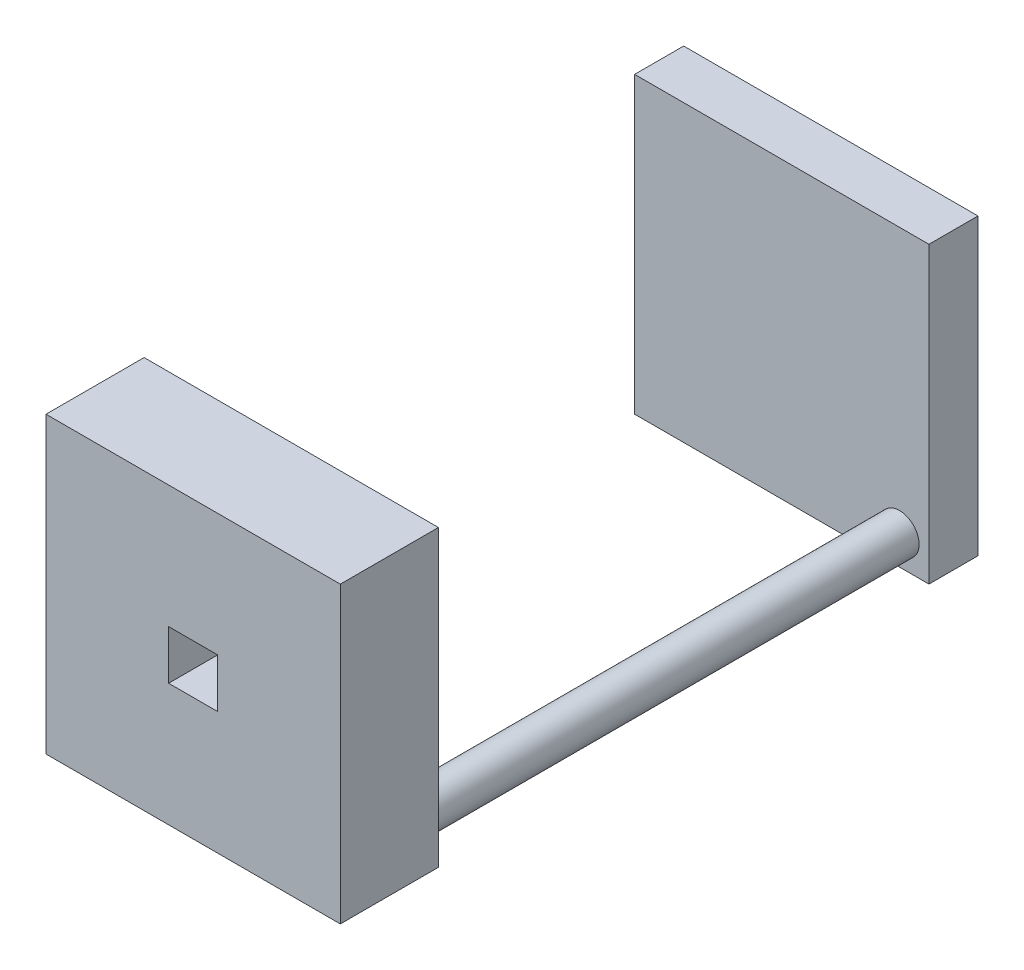
ISO-10303-21;
HEADER;
FILE_DESCRIPTION(('STEP AP214'),'2;1');
FILE_NAME('part.step','',(''),(''),'','','');
FILE_SCHEMA(('AUTOMOTIVE_DESIGN { 1 0 10303 214 1 1 1 1 }'));
ENDSEC;
DATA;
#1=APPLICATION_CONTEXT('core data for automotive mechanical design processes');
#2=APPLICATION_PROTOCOL_DEFINITION('international standard','automotive_design',2000,#1);
#3=PRODUCT_CONTEXT('',#1,'mechanical');
#4=PRODUCT('Part','Part','',(#3));
#5=PRODUCT_RELATED_PRODUCT_CATEGORY('part','',(#4));
#6=PRODUCT_DEFINITION_FORMATION('','',#4);
#7=PRODUCT_DEFINITION_CONTEXT('part definition',#1,'design');
#8=PRODUCT_DEFINITION('design','',#6,#7);
#9=PRODUCT_DEFINITION_SHAPE('','',#8);
#10=(LENGTH_UNIT() NAMED_UNIT(*) SI_UNIT(.MILLI.,.METRE.));
#11=(NAMED_UNIT(*) PLANE_ANGLE_UNIT() SI_UNIT($,.RADIAN.));
#12=(NAMED_UNIT(*) SI_UNIT($,.STERADIAN.) SOLID_ANGLE_UNIT());
#13=UNCERTAINTY_MEASURE_WITH_UNIT(LENGTH_MEASURE(1.E-05),#10,'distance_accuracy_value','');
#14=(GEOMETRIC_REPRESENTATION_CONTEXT(3) GLOBAL_UNCERTAINTY_ASSIGNED_CONTEXT((#13)) GLOBAL_UNIT_ASSIGNED_CONTEXT((#10,
#11,#12)) REPRESENTATION_CONTEXT('',''));
#15=CARTESIAN_POINT('',(0.,0.,0.));
#16=DIRECTION('',(0.,0.,1.));
#17=DIRECTION('',(1.,0.,0.));
#18=AXIS2_PLACEMENT_3D('',#15,#16,#17);
#19=CARTESIAN_POINT('',(0.,30.,0.));
#20=DIRECTION('',(0.,0.,-1.));
#21=DIRECTION('',(-1.,0.,0.));
#22=AXIS2_PLACEMENT_3D('',#19,#20,#21);
#23=PLANE('',#22);
#24=CARTESIAN_POINT('',(27.,3.,0.));
#25=DIRECTION('',(0.,0.,-1.));
#26=DIRECTION('',(-1.,0.,0.));
#27=AXIS2_PLACEMENT_3D('',#24,#25,#26);
#28=CIRCLE('',#27,2.);
#29=CARTESIAN_POINT('',(25.,3.,0.));
#30=VERTEX_POINT('',#29);
#31=EDGE_CURVE('E171',#30,#30,#28,.T.);
#32=ORIENTED_EDGE('',*,*,#31,.F.);
#33=EDGE_LOOP('',(#32));
#34=FACE_BOUND('',#33,.T.);
#35=DIRECTION('',(0.,-1.,0.));
#36=VECTOR('',#35,1.);
#37=CARTESIAN_POINT('',(0.,0.,0.));
#38=LINE('',#37,#36);
#39=CARTESIAN_POINT('',(0.,30.,0.));
#40=VERTEX_POINT('',#39);
#41=CARTESIAN_POINT('',(0.,0.,0.));
#42=VERTEX_POINT('',#41);
#43=EDGE_CURVE('E160',#40,#42,#38,.T.);
#44=ORIENTED_EDGE('',*,*,#43,.F.);
#45=DIRECTION('',(-1.,0.,0.));
#46=VECTOR('',#45,1.);
#47=CARTESIAN_POINT('',(0.,30.,0.));
#48=LINE('',#47,#46);
#49=CARTESIAN_POINT('',(30.,30.,0.));
#50=VERTEX_POINT('',#49);
#51=EDGE_CURVE('E153',#50,#40,#48,.T.);
#52=ORIENTED_EDGE('',*,*,#51,.F.);
#53=DIRECTION('',(0.,1.,0.));
#54=VECTOR('',#53,1.);
#55=CARTESIAN_POINT('',(30.,0.,0.));
#56=LINE('',#55,#54);
#57=CARTESIAN_POINT('',(30.,0.,0.));
#58=VERTEX_POINT('',#57);
#59=EDGE_CURVE('E156',#58,#50,#56,.T.);
#60=ORIENTED_EDGE('',*,*,#59,.F.);
#61=DIRECTION('',(1.,0.,0.));
#62=VECTOR('',#61,1.);
#63=CARTESIAN_POINT('',(0.,0.,0.));
#64=LINE('',#63,#62);
#65=EDGE_CURVE('E158',#42,#58,#64,.T.);
#66=ORIENTED_EDGE('',*,*,#65,.F.);
#67=EDGE_LOOP('',(#44,#52,#60,#66));
#68=FACE_BOUND('',#67,.T.);
#69=DIRECTION('',(-1.,0.,0.));
#70=VECTOR('',#69,1.);
#71=CARTESIAN_POINT('',(0.,17.5,0.));
#72=LINE('',#71,#70);
#73=CARTESIAN_POINT('',(17.5,17.5,0.));
#74=VERTEX_POINT('',#73);
#75=CARTESIAN_POINT('',(12.5,17.5,0.));
#76=VERTEX_POINT('',#75);
#77=EDGE_CURVE('E213',#74,#76,#72,.T.);
#78=ORIENTED_EDGE('',*,*,#77,.T.);
#79=DIRECTION('',(0.,-1.,0.));
#80=VECTOR('',#79,1.);
#81=CARTESIAN_POINT('',(12.5,30.,0.));
#82=LINE('',#81,#80);
#83=CARTESIAN_POINT('',(12.5,12.5,0.));
#84=VERTEX_POINT('',#83);
#85=EDGE_CURVE('E131',#76,#84,#82,.T.);
#86=ORIENTED_EDGE('',*,*,#85,.T.);
#87=DIRECTION('',(1.,0.,0.));
#88=VECTOR('',#87,1.);
#89=CARTESIAN_POINT('',(0.,12.5,0.));
#90=LINE('',#89,#88);
#91=CARTESIAN_POINT('',(17.5,12.5,0.));
#92=VERTEX_POINT('',#91);
#93=EDGE_CURVE('E207',#84,#92,#90,.T.);
#94=ORIENTED_EDGE('',*,*,#93,.T.);
#95=DIRECTION('',(0.,1.,0.));
#96=VECTOR('',#95,1.);
#97=CARTESIAN_POINT('',(17.5,30.,0.));
#98=LINE('',#97,#96);
#99=EDGE_CURVE('E210',#92,#74,#98,.T.);
#100=ORIENTED_EDGE('',*,*,#99,.T.);
#101=EDGE_LOOP('',(#78,#86,#94,#100));
#102=FACE_BOUND('',#101,.T.);
#103=ADVANCED_FACE('F33',(#34,#68,#102),#23,.T.);
#104=CARTESIAN_POINT('',(0.,30.,10.));
#105=DIRECTION('',(0.,0.,-1.));
#106=DIRECTION('',(-1.,0.,0.));
#107=AXIS2_PLACEMENT_3D('',#104,#105,#106);
#108=PLANE('',#107);
#109=DIRECTION('',(0.,-1.,0.));
#110=VECTOR('',#109,1.);
#111=CARTESIAN_POINT('',(0.,0.,10.));
#112=LINE('',#111,#110);
#113=CARTESIAN_POINT('',(0.,30.,10.));
#114=VERTEX_POINT('',#113);
#115=CARTESIAN_POINT('',(0.,0.,10.));
#116=VERTEX_POINT('',#115);
#117=EDGE_CURVE('E155',#114,#116,#112,.T.);
#118=ORIENTED_EDGE('',*,*,#117,.T.);
#119=DIRECTION('',(1.,0.,0.));
#120=VECTOR('',#119,1.);
#121=CARTESIAN_POINT('',(0.,0.,10.));
#122=LINE('',#121,#120);
#123=CARTESIAN_POINT('',(30.,0.,10.));
#124=VERTEX_POINT('',#123);
#125=EDGE_CURVE('E167',#116,#124,#122,.T.);
#126=ORIENTED_EDGE('',*,*,#125,.T.);
#127=DIRECTION('',(0.,1.,0.));
#128=VECTOR('',#127,1.);
#129=CARTESIAN_POINT('',(30.,0.,10.));
#130=LINE('',#129,#128);
#131=CARTESIAN_POINT('',(30.,30.,10.));
#132=VERTEX_POINT('',#131);
#133=EDGE_CURVE('E165',#124,#132,#130,.T.);
#134=ORIENTED_EDGE('',*,*,#133,.T.);
#135=DIRECTION('',(-1.,0.,0.));
#136=VECTOR('',#135,1.);
#137=CARTESIAN_POINT('',(0.,30.,10.));
#138=LINE('',#137,#136);
#139=EDGE_CURVE('E152',#132,#114,#138,.T.);
#140=ORIENTED_EDGE('',*,*,#139,.T.);
#141=EDGE_LOOP('',(#118,#126,#134,#140));
#142=FACE_BOUND('',#141,.T.);
#143=DIRECTION('',(0.,-1.,0.));
#144=VECTOR('',#143,1.);
#145=CARTESIAN_POINT('',(12.5,30.,10.));
#146=LINE('',#145,#144);
#147=CARTESIAN_POINT('',(12.5,17.5,10.));
#148=VERTEX_POINT('',#147);
#149=CARTESIAN_POINT('',(12.5,12.5,10.));
#150=VERTEX_POINT('',#149);
#151=EDGE_CURVE('E11',#148,#150,#146,.T.);
#152=ORIENTED_EDGE('',*,*,#151,.F.);
#153=DIRECTION('',(-1.,0.,0.));
#154=VECTOR('',#153,1.);
#155=CARTESIAN_POINT('',(0.,17.5,10.));
#156=LINE('',#155,#154);
#157=CARTESIAN_POINT('',(17.5,17.5,10.));
#158=VERTEX_POINT('',#157);
#159=EDGE_CURVE('E118',#158,#148,#156,.T.);
#160=ORIENTED_EDGE('',*,*,#159,.F.);
#161=DIRECTION('',(0.,1.,0.));
#162=VECTOR('',#161,1.);
#163=CARTESIAN_POINT('',(17.5,30.,10.));
#164=LINE('',#163,#162);
#165=CARTESIAN_POINT('',(17.5,12.5,10.));
#166=VERTEX_POINT('',#165);
#167=EDGE_CURVE('E123',#166,#158,#164,.T.);
#168=ORIENTED_EDGE('',*,*,#167,.F.);
#169=DIRECTION('',(1.,0.,0.));
#170=VECTOR('',#169,1.);
#171=CARTESIAN_POINT('',(0.,12.5,10.));
#172=LINE('',#171,#170);
#173=EDGE_CURVE('E41',#150,#166,#172,.T.);
#174=ORIENTED_EDGE('',*,*,#173,.F.);
#175=EDGE_LOOP('',(#152,#160,#168,#174));
#176=FACE_BOUND('',#175,.T.);
#177=ADVANCED_FACE('F135',(#142,#176),#108,.F.);
#178=CARTESIAN_POINT('',(0.,0.,10.));
#179=DIRECTION('',(1.,0.,0.));
#180=DIRECTION('',(0.,1.,0.));
#181=AXIS2_PLACEMENT_3D('',#178,#179,#180);
#182=PLANE('',#181);
#183=ORIENTED_EDGE('',*,*,#43,.T.);
#184=DIRECTION('',(0.,0.,-1.));
#185=VECTOR('',#184,1.);
#186=CARTESIAN_POINT('',(0.,0.,10.));
#187=LINE('',#186,#185);
#188=EDGE_CURVE('E124',#116,#42,#187,.T.);
#189=ORIENTED_EDGE('',*,*,#188,.F.);
#190=ORIENTED_EDGE('',*,*,#117,.F.);
#191=DIRECTION('',(0.,0.,-1.));
#192=VECTOR('',#191,1.);
#193=CARTESIAN_POINT('',(0.,30.,10.));
#194=LINE('',#193,#192);
#195=EDGE_CURVE('E149',#114,#40,#194,.T.);
#196=ORIENTED_EDGE('',*,*,#195,.T.);
#197=EDGE_LOOP('',(#183,#189,#190,#196));
#198=FACE_BOUND('',#197,.T.);
#199=ADVANCED_FACE('F35',(#198),#182,.F.);
#200=CARTESIAN_POINT('',(0.,0.,10.));
#201=DIRECTION('',(0.,1.,0.));
#202=DIRECTION('',(0.,0.,1.));
#203=AXIS2_PLACEMENT_3D('',#200,#201,#202);
#204=PLANE('',#203);
#205=ORIENTED_EDGE('',*,*,#65,.T.);
#206=DIRECTION('',(0.,0.,-1.));
#207=VECTOR('',#206,1.);
#208=CARTESIAN_POINT('',(30.,0.,10.));
#209=LINE('',#208,#207);
#210=EDGE_CURVE('E143',#124,#58,#209,.T.);
#211=ORIENTED_EDGE('',*,*,#210,.F.);
#212=ORIENTED_EDGE('',*,*,#125,.F.);
#213=ORIENTED_EDGE('',*,*,#188,.T.);
#214=EDGE_LOOP('',(#205,#211,#212,#213));
#215=FACE_BOUND('',#214,.T.);
#216=ADVANCED_FACE('F252',(#215),#204,.F.);
#217=CARTESIAN_POINT('',(30.,0.,10.));
#218=DIRECTION('',(-1.,0.,0.));
#219=DIRECTION('',(0.,-1.,0.));
#220=AXIS2_PLACEMENT_3D('',#217,#218,#219);
#221=PLANE('',#220);
#222=ORIENTED_EDGE('',*,*,#59,.T.);
#223=DIRECTION('',(0.,0.,-1.));
#224=VECTOR('',#223,1.);
#225=CARTESIAN_POINT('',(30.,30.,10.));
#226=LINE('',#225,#224);
#227=EDGE_CURVE('E146',#132,#50,#226,.T.);
#228=ORIENTED_EDGE('',*,*,#227,.F.);
#229=ORIENTED_EDGE('',*,*,#133,.F.);
#230=ORIENTED_EDGE('',*,*,#210,.T.);
#231=EDGE_LOOP('',(#222,#228,#229,#230));
#232=FACE_BOUND('',#231,.T.);
#233=ADVANCED_FACE('F249',(#232),#221,.F.);
#234=CARTESIAN_POINT('',(0.,30.,10.));
#235=DIRECTION('',(0.,-1.,0.));
#236=DIRECTION('',(0.,0.,-1.));
#237=AXIS2_PLACEMENT_3D('',#234,#235,#236);
#238=PLANE('',#237);
#239=ORIENTED_EDGE('',*,*,#51,.T.);
#240=ORIENTED_EDGE('',*,*,#195,.F.);
#241=ORIENTED_EDGE('',*,*,#139,.F.);
#242=ORIENTED_EDGE('',*,*,#227,.T.);
#243=EDGE_LOOP('',(#239,#240,#241,#242));
#244=FACE_BOUND('',#243,.T.);
#245=ADVANCED_FACE('F245',(#244),#238,.F.);
#246=CARTESIAN_POINT('',(27.,3.,-50.));
#247=DIRECTION('',(0.,0.,1.));
#248=DIRECTION('',(1.,0.,0.));
#249=AXIS2_PLACEMENT_3D('',#246,#247,#248);
#250=CYLINDRICAL_SURFACE('',#249,2.);
#251=CARTESIAN_POINT('',(27.,3.,-50.));
#252=DIRECTION('',(0.,0.,-1.));
#253=DIRECTION('',(-1.,0.,0.));
#254=AXIS2_PLACEMENT_3D('',#251,#252,#253);
#255=CIRCLE('',#254,2.);
#256=CARTESIAN_POINT('',(25.,3.,-50.));
#257=VERTEX_POINT('',#256);
#258=EDGE_CURVE('E163',#257,#257,#255,.T.);
#259=ORIENTED_EDGE('',*,*,#258,.F.);
#260=EDGE_LOOP('',(#259));
#261=FACE_BOUND('',#260,.T.);
#262=ORIENTED_EDGE('',*,*,#31,.T.);
#263=EDGE_LOOP('',(#262));
#264=FACE_BOUND('',#263,.T.);
#265=ADVANCED_FACE('F248',(#261,#264),#250,.T.);
#266=CARTESIAN_POINT('',(30.,30.,-50.));
#267=DIRECTION('',(0.,0.,1.));
#268=DIRECTION('',(1.,0.,0.));
#269=AXIS2_PLACEMENT_3D('',#266,#267,#268);
#270=PLANE('',#269);
#271=DIRECTION('',(0.,-1.,0.));
#272=VECTOR('',#271,1.);
#273=CARTESIAN_POINT('',(30.,0.,-50.));
#274=LINE('',#273,#272);
#275=CARTESIAN_POINT('',(30.,30.,-50.));
#276=VERTEX_POINT('',#275);
#277=CARTESIAN_POINT('',(30.,0.,-50.));
#278=VERTEX_POINT('',#277);
#279=EDGE_CURVE('E196',#276,#278,#274,.T.);
#280=ORIENTED_EDGE('',*,*,#279,.F.);
#281=DIRECTION('',(1.,0.,0.));
#282=VECTOR('',#281,1.);
#283=CARTESIAN_POINT('',(30.,30.,-50.));
#284=LINE('',#283,#282);
#285=CARTESIAN_POINT('',(0.,30.,-50.));
#286=VERTEX_POINT('',#285);
#287=EDGE_CURVE('E189',#286,#276,#284,.T.);
#288=ORIENTED_EDGE('',*,*,#287,.F.);
#289=DIRECTION('',(0.,1.,0.));
#290=VECTOR('',#289,1.);
#291=CARTESIAN_POINT('',(0.,0.,-50.));
#292=LINE('',#291,#290);
#293=CARTESIAN_POINT('',(0.,0.,-50.));
#294=VERTEX_POINT('',#293);
#295=EDGE_CURVE('E192',#294,#286,#292,.T.);
#296=ORIENTED_EDGE('',*,*,#295,.F.);
#297=DIRECTION('',(-1.,0.,0.));
#298=VECTOR('',#297,1.);
#299=CARTESIAN_POINT('',(30.,0.,-50.));
#300=LINE('',#299,#298);
#301=EDGE_CURVE('E194',#278,#294,#300,.T.);
#302=ORIENTED_EDGE('',*,*,#301,.F.);
#303=EDGE_LOOP('',(#280,#288,#296,#302));
#304=FACE_BOUND('',#303,.T.);
#305=ORIENTED_EDGE('',*,*,#258,.T.);
#306=EDGE_LOOP('',(#305));
#307=FACE_BOUND('',#306,.T.);
#308=ADVANCED_FACE('F297',(#304,#307),#270,.T.);
#309=CARTESIAN_POINT('',(30.,0.,-55.));
#310=DIRECTION('',(-1.,0.,0.));
#311=DIRECTION('',(0.,0.,1.));
#312=AXIS2_PLACEMENT_3D('',#309,#310,#311);
#313=PLANE('',#312);
#314=ORIENTED_EDGE('',*,*,#279,.T.);
#315=DIRECTION('',(0.,0.,1.));
#316=VECTOR('',#315,1.);
#317=CARTESIAN_POINT('',(30.,0.,-55.));
#318=LINE('',#317,#316);
#319=CARTESIAN_POINT('',(30.,0.,-55.));
#320=VERTEX_POINT('',#319);
#321=EDGE_CURVE('E174',#320,#278,#318,.T.);
#322=ORIENTED_EDGE('',*,*,#321,.F.);
#323=DIRECTION('',(0.,-1.,0.));
#324=VECTOR('',#323,1.);
#325=CARTESIAN_POINT('',(30.,0.,-55.));
#326=LINE('',#325,#324);
#327=CARTESIAN_POINT('',(30.,30.,-55.));
#328=VERTEX_POINT('',#327);
#329=EDGE_CURVE('E191',#328,#320,#326,.T.);
#330=ORIENTED_EDGE('',*,*,#329,.F.);
#331=DIRECTION('',(0.,0.,1.));
#332=VECTOR('',#331,1.);
#333=CARTESIAN_POINT('',(30.,30.,-55.));
#334=LINE('',#333,#332);
#335=EDGE_CURVE('E185',#328,#276,#334,.T.);
#336=ORIENTED_EDGE('',*,*,#335,.T.);
#337=EDGE_LOOP('',(#314,#322,#330,#336));
#338=FACE_BOUND('',#337,.T.);
#339=ADVANCED_FACE('F306',(#338),#313,.F.);
#340=CARTESIAN_POINT('',(30.,0.,-55.));
#341=DIRECTION('',(0.,1.,0.));
#342=DIRECTION('',(0.,0.,1.));
#343=AXIS2_PLACEMENT_3D('',#340,#341,#342);
#344=PLANE('',#343);
#345=ORIENTED_EDGE('',*,*,#301,.T.);
#346=DIRECTION('',(0.,0.,1.));
#347=VECTOR('',#346,1.);
#348=CARTESIAN_POINT('',(0.,0.,-55.));
#349=LINE('',#348,#347);
#350=CARTESIAN_POINT('',(0.,0.,-55.));
#351=VERTEX_POINT('',#350);
#352=EDGE_CURVE('E179',#351,#294,#349,.T.);
#353=ORIENTED_EDGE('',*,*,#352,.F.);
#354=DIRECTION('',(-1.,0.,0.));
#355=VECTOR('',#354,1.);
#356=CARTESIAN_POINT('',(30.,0.,-55.));
#357=LINE('',#356,#355);
#358=EDGE_CURVE('E202',#320,#351,#357,.T.);
#359=ORIENTED_EDGE('',*,*,#358,.F.);
#360=ORIENTED_EDGE('',*,*,#321,.T.);
#361=EDGE_LOOP('',(#345,#353,#359,#360));
#362=FACE_BOUND('',#361,.T.);
#363=ADVANCED_FACE('F316',(#362),#344,.F.);
#364=CARTESIAN_POINT('',(0.,0.,-55.));
#365=DIRECTION('',(1.,0.,0.));
#366=DIRECTION('',(0.,0.,-1.));
#367=AXIS2_PLACEMENT_3D('',#364,#365,#366);
#368=PLANE('',#367);
#369=ORIENTED_EDGE('',*,*,#295,.T.);
#370=DIRECTION('',(0.,0.,1.));
#371=VECTOR('',#370,1.);
#372=CARTESIAN_POINT('',(0.,30.,-55.));
#373=LINE('',#372,#371);
#374=CARTESIAN_POINT('',(0.,30.,-55.));
#375=VERTEX_POINT('',#374);
#376=EDGE_CURVE('E182',#375,#286,#373,.T.);
#377=ORIENTED_EDGE('',*,*,#376,.F.);
#378=DIRECTION('',(0.,1.,0.));
#379=VECTOR('',#378,1.);
#380=CARTESIAN_POINT('',(0.,0.,-55.));
#381=LINE('',#380,#379);
#382=EDGE_CURVE('E200',#351,#375,#381,.T.);
#383=ORIENTED_EDGE('',*,*,#382,.F.);
#384=ORIENTED_EDGE('',*,*,#352,.T.);
#385=EDGE_LOOP('',(#369,#377,#383,#384));
#386=FACE_BOUND('',#385,.T.);
#387=ADVANCED_FACE('F326',(#386),#368,.F.);
#388=CARTESIAN_POINT('',(30.,30.,-55.));
#389=DIRECTION('',(0.,-1.,0.));
#390=DIRECTION('',(0.,0.,-1.));
#391=AXIS2_PLACEMENT_3D('',#388,#389,#390);
#392=PLANE('',#391);
#393=ORIENTED_EDGE('',*,*,#287,.T.);
#394=ORIENTED_EDGE('',*,*,#335,.F.);
#395=DIRECTION('',(1.,0.,0.));
#396=VECTOR('',#395,1.);
#397=CARTESIAN_POINT('',(30.,30.,-55.));
#398=LINE('',#397,#396);
#399=EDGE_CURVE('E188',#375,#328,#398,.T.);
#400=ORIENTED_EDGE('',*,*,#399,.F.);
#401=ORIENTED_EDGE('',*,*,#376,.T.);
#402=EDGE_LOOP('',(#393,#394,#400,#401));
#403=FACE_BOUND('',#402,.T.);
#404=ADVANCED_FACE('F336',(#403),#392,.F.);
#405=CARTESIAN_POINT('',(30.,30.,-55.));
#406=DIRECTION('',(0.,0.,1.));
#407=DIRECTION('',(1.,0.,0.));
#408=AXIS2_PLACEMENT_3D('',#405,#406,#407);
#409=PLANE('',#408);
#410=ORIENTED_EDGE('',*,*,#329,.T.);
#411=ORIENTED_EDGE('',*,*,#358,.T.);
#412=ORIENTED_EDGE('',*,*,#382,.T.);
#413=ORIENTED_EDGE('',*,*,#399,.T.);
#414=EDGE_LOOP('',(#410,#411,#412,#413));
#415=FACE_BOUND('',#414,.T.);
#416=ADVANCED_FACE('F230',(#415),#409,.F.);
#417=CARTESIAN_POINT('',(12.5,12.5,35.340726549431));
#418=DIRECTION('',(1.,0.,0.));
#419=DIRECTION('',(0.,0.,-1.));
#420=AXIS2_PLACEMENT_3D('',#417,#418,#419);
#421=PLANE('',#420);
#422=DIRECTION('',(0.,0.,-1.));
#423=VECTOR('',#422,1.);
#424=CARTESIAN_POINT('',(12.5,17.5,35.340726549431));
#425=LINE('',#424,#423);
#426=EDGE_CURVE('E48',#148,#76,#425,.T.);
#427=ORIENTED_EDGE('',*,*,#426,.F.);
#428=ORIENTED_EDGE('',*,*,#151,.T.);
#429=DIRECTION('',(0.,0.,-1.));
#430=VECTOR('',#429,1.);
#431=CARTESIAN_POINT('',(12.5,12.5,35.340726549431));
#432=LINE('',#431,#430);
#433=EDGE_CURVE('E215',#150,#84,#432,.T.);
#434=ORIENTED_EDGE('',*,*,#433,.T.);
#435=ORIENTED_EDGE('',*,*,#85,.F.);
#436=EDGE_LOOP('',(#427,#428,#434,#435));
#437=FACE_BOUND('',#436,.T.);
#438=ADVANCED_FACE('F127',(#437),#421,.T.);
#439=CARTESIAN_POINT('',(12.5,12.5,35.340726549431));
#440=DIRECTION('',(0.,1.,0.));
#441=DIRECTION('',(0.,0.,1.));
#442=AXIS2_PLACEMENT_3D('',#439,#440,#441);
#443=PLANE('',#442);
#444=ORIENTED_EDGE('',*,*,#433,.F.);
#445=ORIENTED_EDGE('',*,*,#173,.T.);
#446=DIRECTION('',(0.,0.,-1.));
#447=VECTOR('',#446,1.);
#448=CARTESIAN_POINT('',(17.5,12.5,35.340726549431));
#449=LINE('',#448,#447);
#450=EDGE_CURVE('E217',#166,#92,#449,.T.);
#451=ORIENTED_EDGE('',*,*,#450,.T.);
#452=ORIENTED_EDGE('',*,*,#93,.F.);
#453=EDGE_LOOP('',(#444,#445,#451,#452));
#454=FACE_BOUND('',#453,.T.);
#455=ADVANCED_FACE('F222',(#454),#443,.T.);
#456=CARTESIAN_POINT('',(17.5,12.5,35.340726549431));
#457=DIRECTION('',(-1.,0.,0.));
#458=DIRECTION('',(0.,0.,1.));
#459=AXIS2_PLACEMENT_3D('',#456,#457,#458);
#460=PLANE('',#459);
#461=ORIENTED_EDGE('',*,*,#450,.F.);
#462=ORIENTED_EDGE('',*,*,#167,.T.);
#463=DIRECTION('',(0.,0.,-1.));
#464=VECTOR('',#463,1.);
#465=CARTESIAN_POINT('',(17.5,17.5,35.340726549431));
#466=LINE('',#465,#464);
#467=EDGE_CURVE('E53',#158,#74,#466,.T.);
#468=ORIENTED_EDGE('',*,*,#467,.T.);
#469=ORIENTED_EDGE('',*,*,#99,.F.);
#470=EDGE_LOOP('',(#461,#462,#468,#469));
#471=FACE_BOUND('',#470,.T.);
#472=ADVANCED_FACE('F220',(#471),#460,.T.);
#473=CARTESIAN_POINT('',(12.5,17.5,35.340726549431));
#474=DIRECTION('',(0.,-1.,0.));
#475=DIRECTION('',(0.,0.,-1.));
#476=AXIS2_PLACEMENT_3D('',#473,#474,#475);
#477=PLANE('',#476);
#478=ORIENTED_EDGE('',*,*,#467,.F.);
#479=ORIENTED_EDGE('',*,*,#159,.T.);
#480=ORIENTED_EDGE('',*,*,#426,.T.);
#481=ORIENTED_EDGE('',*,*,#77,.F.);
#482=EDGE_LOOP('',(#478,#479,#480,#481));
#483=FACE_BOUND('',#482,.T.);
#484=ADVANCED_FACE('F119',(#483),#477,.T.);
#485=CLOSED_SHELL('',(#103,#177,#199,#216,#233,#245,#265,#308,#339,#363,#387,#404,#416,#438,
#455,#472,#484));
#486=MANIFOLD_SOLID_BREP('B2',#485);
#487=ADVANCED_BREP_SHAPE_REPRESENTATION('',(#18,#486),#14);
#488=SHAPE_DEFINITION_REPRESENTATION(#9,#487);
ENDSEC;
END-ISO-10303-21;
